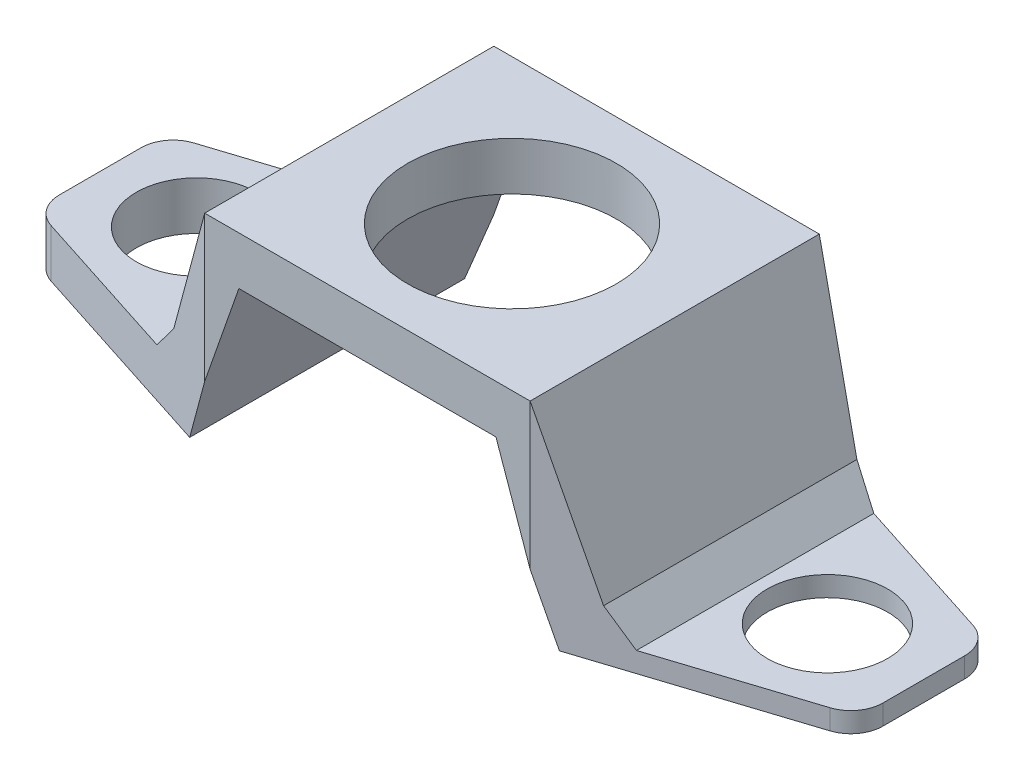
ISO-10303-21;
HEADER;
FILE_DESCRIPTION(('STEP AP214'),'2;1');
FILE_NAME('part.step','',(''),(''),'','','');
FILE_SCHEMA(('AUTOMOTIVE_DESIGN { 1 0 10303 214 1 1 1 1 }'));
ENDSEC;
DATA;
#1=APPLICATION_CONTEXT('core data for automotive mechanical design processes');
#2=APPLICATION_PROTOCOL_DEFINITION('international standard','automotive_design',2000,#1);
#3=PRODUCT_CONTEXT('',#1,'mechanical');
#4=PRODUCT('Part','Part','',(#3));
#5=PRODUCT_RELATED_PRODUCT_CATEGORY('part','',(#4));
#6=PRODUCT_DEFINITION_FORMATION('','',#4);
#7=PRODUCT_DEFINITION_CONTEXT('part definition',#1,'design');
#8=PRODUCT_DEFINITION('design','',#6,#7);
#9=PRODUCT_DEFINITION_SHAPE('','',#8);
#10=(LENGTH_UNIT() NAMED_UNIT(*) SI_UNIT(.MILLI.,.METRE.));
#11=(NAMED_UNIT(*) PLANE_ANGLE_UNIT() SI_UNIT($,.RADIAN.));
#12=(NAMED_UNIT(*) SI_UNIT($,.STERADIAN.) SOLID_ANGLE_UNIT());
#13=UNCERTAINTY_MEASURE_WITH_UNIT(LENGTH_MEASURE(1.E-05),#10,'distance_accuracy_value','');
#14=(GEOMETRIC_REPRESENTATION_CONTEXT(3) GLOBAL_UNCERTAINTY_ASSIGNED_CONTEXT((#13)) GLOBAL_UNIT_ASSIGNED_CONTEXT((#10,
#11,#12)) REPRESENTATION_CONTEXT('',''));
#15=CARTESIAN_POINT('',(0.,0.,0.));
#16=DIRECTION('',(0.,0.,1.));
#17=DIRECTION('',(1.,0.,0.));
#18=AXIS2_PLACEMENT_3D('',#15,#16,#17);
#19=CARTESIAN_POINT('',(-25.6335765484451,3.,9.));
#20=DIRECTION('',(1.,0.,0.));
#21=DIRECTION('',(0.,0.,-1.));
#22=AXIS2_PLACEMENT_3D('',#19,#20,#21);
#23=PLANE('',#22);
#24=DIRECTION('',(0.,0.,-1.));
#25=VECTOR('',#24,1.);
#26=CARTESIAN_POINT('',(-25.6335765484451,3.,9.));
#27=LINE('',#26,#25);
#28=CARTESIAN_POINT('',(-25.6335765484451,3.,2.54349252311762));
#29=VERTEX_POINT('',#28);
#30=CARTESIAN_POINT('',(-25.6335765484451,3.,-2.54349252311763));
#31=VERTEX_POINT('',#30);
#32=EDGE_CURVE('E199',#29,#31,#27,.T.);
#33=ORIENTED_EDGE('',*,*,#32,.T.);
#34=DIRECTION('',(0.,1.,0.));
#35=VECTOR('',#34,1.);
#36=CARTESIAN_POINT('',(-25.6335765484451,3.,-2.54349252311763));
#37=LINE('',#36,#35);
#38=CARTESIAN_POINT('',(-25.6335765484451,0.,-2.54349252311763));
#39=VERTEX_POINT('',#38);
#40=EDGE_CURVE('E280',#31,#39,#37,.F.);
#41=ORIENTED_EDGE('',*,*,#40,.T.);
#42=DIRECTION('',(0.,0.,-1.));
#43=VECTOR('',#42,1.);
#44=CARTESIAN_POINT('',(-25.6335765484451,0.,9.));
#45=LINE('',#44,#43);
#46=CARTESIAN_POINT('',(-25.6335765484451,0.,2.54349252311762));
#47=VERTEX_POINT('',#46);
#48=EDGE_CURVE('E236',#47,#39,#45,.T.);
#49=ORIENTED_EDGE('',*,*,#48,.F.);
#50=DIRECTION('',(0.,1.,0.));
#51=VECTOR('',#50,1.);
#52=CARTESIAN_POINT('',(-25.6335765484451,3.,2.54349252311762));
#53=LINE('',#52,#51);
#54=EDGE_CURVE('E277',#47,#29,#53,.T.);
#55=ORIENTED_EDGE('',*,*,#54,.T.);
#56=EDGE_LOOP('',(#33,#41,#49,#55));
#57=FACE_BOUND('',#56,.T.);
#58=ADVANCED_FACE('F33',(#57),#23,.F.);
#59=CARTESIAN_POINT('',(-25.6335765484451,0.,9.));
#60=DIRECTION('',(0.,1.,0.));
#61=DIRECTION('',(-1.,0.,0.));
#62=AXIS2_PLACEMENT_3D('',#59,#60,#61);
#63=PLANE('',#62);
#64=CARTESIAN_POINT('',(-19.6335765484451,0.,0.));
#65=DIRECTION('',(0.,1.,0.));
#66=DIRECTION('',(-1.,0.,0.));
#67=AXIS2_PLACEMENT_3D('',#64,#65,#66);
#68=CIRCLE('',#67,3.75);
#69=CARTESIAN_POINT('',(-19.6335765484451,0.,3.75));
#70=VERTEX_POINT('',#69);
#71=EDGE_CURVE('E322',#70,#70,#68,.F.);
#72=ORIENTED_EDGE('',*,*,#71,.F.);
#73=EDGE_LOOP('',(#72));
#74=FACE_BOUND('',#73,.T.);
#75=ORIENTED_EDGE('',*,*,#48,.T.);
#76=CARTESIAN_POINT('',(-23.6335765484451,0.,-2.54349252311763));
#77=DIRECTION('',(0.,1.,0.));
#78=DIRECTION('',(-1.,0.,0.));
#79=AXIS2_PLACEMENT_3D('',#76,#77,#78);
#80=CIRCLE('',#79,2.);
#81=CARTESIAN_POINT('',(-24.2473517188595,0.,-4.44698406241662));
#82=VERTEX_POINT('',#81);
#83=EDGE_CURVE('E284',#39,#82,#80,.F.);
#84=ORIENTED_EDGE('',*,*,#83,.T.);
#85=DIRECTION('',(0.951745769649497,0.,-0.306887585207168));
#86=VECTOR('',#85,1.);
#87=CARTESIAN_POINT('',(-29.4306030411705,0.,-2.77566013059427));
#88=LINE('',#87,#86);
#89=CARTESIAN_POINT('',(-11.5064234515549,0.,-8.55525838728262));
#90=VERTEX_POINT('',#89);
#91=EDGE_CURVE('E354',#82,#90,#88,.T.);
#92=ORIENTED_EDGE('',*,*,#91,.T.);
#93=DIRECTION('',(0.,0.,-1.));
#94=VECTOR('',#93,1.);
#95=CARTESIAN_POINT('',(-11.5064234515549,0.,9.));
#96=LINE('',#95,#94);
#97=CARTESIAN_POINT('',(-11.5064234515549,0.,8.55525838728262));
#98=VERTEX_POINT('',#97);
#99=EDGE_CURVE('E233',#98,#90,#96,.T.);
#100=ORIENTED_EDGE('',*,*,#99,.F.);
#101=DIRECTION('',(-0.951745769649497,0.,-0.306887585207168));
#102=VECTOR('',#101,1.);
#103=CARTESIAN_POINT('',(-24.1731817435508,0.,4.47089994977144));
#104=LINE('',#103,#102);
#105=CARTESIAN_POINT('',(-24.2473517188595,0.,4.44698406241662));
#106=VERTEX_POINT('',#105);
#107=EDGE_CURVE('E344',#98,#106,#104,.T.);
#108=ORIENTED_EDGE('',*,*,#107,.T.);
#109=CARTESIAN_POINT('',(-23.6335765484451,0.,2.54349252311762));
#110=DIRECTION('',(0.,1.,0.));
#111=DIRECTION('',(-1.,0.,0.));
#112=AXIS2_PLACEMENT_3D('',#109,#110,#111);
#113=CIRCLE('',#112,2.);
#114=EDGE_CURVE('E282',#106,#47,#113,.F.);
#115=ORIENTED_EDGE('',*,*,#114,.T.);
#116=EDGE_LOOP('',(#75,#84,#92,#100,#108,#115));
#117=FACE_BOUND('',#116,.T.);
#118=ADVANCED_FACE('F422',(#74,#117),#63,.F.);
#119=CARTESIAN_POINT('',(-11.5064234515549,0.,9.));
#120=DIRECTION('',(-0.943669198352679,0.330890380761382,0.));
#121=DIRECTION('',(-0.330890380761382,-0.943669198352679,0.));
#122=AXIS2_PLACEMENT_3D('',#119,#120,#121);
#123=PLANE('',#122);
#124=DIRECTION('',(0.330890380761382,0.943669198352679,0.));
#125=VECTOR('',#124,1.);
#126=CARTESIAN_POINT('',(-11.5064234515549,0.,9.));
#127=LINE('',#126,#125);
#128=CARTESIAN_POINT('',(-10.1271530968902,3.93355330216324,9.));
#129=VERTEX_POINT('',#128);
#130=CARTESIAN_POINT('',(-8.,10.,9.));
#131=VERTEX_POINT('',#130);
#132=EDGE_CURVE('E201',#129,#131,#127,.T.);
#133=ORIENTED_EDGE('',*,*,#132,.F.);
#134=DIRECTION('',(-0.329022924471758,-0.93834338327237,-0.106092460811382));
#135=VECTOR('',#134,1.);
#136=CARTESIAN_POINT('',(-11.4908989220258,0.0442745428314058,8.56026422553333));
#137=LINE('',#136,#135);
#138=EDGE_CURVE('E341',#129,#98,#137,.T.);
#139=ORIENTED_EDGE('',*,*,#138,.T.);
#140=ORIENTED_EDGE('',*,*,#99,.T.);
#141=DIRECTION('',(0.329022924471758,0.93834338327237,-0.106092460811382));
#142=VECTOR('',#141,1.);
#143=CARTESIAN_POINT('',(-12.119222252996,-1.74764631228258,-8.35766324119506));
#144=LINE('',#143,#142);
#145=CARTESIAN_POINT('',(-10.1271530968903,3.93355330216319,-9.));
#146=VERTEX_POINT('',#145);
#147=EDGE_CURVE('E351',#90,#146,#144,.T.);
#148=ORIENTED_EDGE('',*,*,#147,.T.);
#149=DIRECTION('',(0.330890380761382,0.943669198352679,0.));
#150=VECTOR('',#149,1.);
#151=CARTESIAN_POINT('',(-11.5064234515549,0.,-9.));
#152=LINE('',#151,#150);
#153=CARTESIAN_POINT('',(-8.,10.,-9.));
#154=VERTEX_POINT('',#153);
#155=EDGE_CURVE('E205',#146,#154,#152,.T.);
#156=ORIENTED_EDGE('',*,*,#155,.T.);
#157=DIRECTION('',(0.,0.,-1.));
#158=VECTOR('',#157,1.);
#159=CARTESIAN_POINT('',(-8.,10.,9.));
#160=LINE('',#159,#158);
#161=EDGE_CURVE('E230',#131,#154,#160,.T.);
#162=ORIENTED_EDGE('',*,*,#161,.F.);
#163=EDGE_LOOP('',(#133,#139,#140,#148,#156,#162));
#164=FACE_BOUND('',#163,.T.);
#165=ADVANCED_FACE('F364',(#164),#123,.F.);
#166=CARTESIAN_POINT('',(8.,9.99999999999999,9.));
#167=DIRECTION('',(0.,1.,0.));
#168=DIRECTION('',(0.,0.,1.));
#169=AXIS2_PLACEMENT_3D('',#166,#167,#168);
#170=PLANE('',#169);
#171=CARTESIAN_POINT('',(0.,9.99999999999999,0.));
#172=DIRECTION('',(0.,1.,0.));
#173=DIRECTION('',(0.,0.,1.));
#174=AXIS2_PLACEMENT_3D('',#171,#172,#173);
#175=CIRCLE('',#174,6.5);
#176=CARTESIAN_POINT('',(0.,9.99999999999999,6.5));
#177=VERTEX_POINT('',#176);
#178=EDGE_CURVE('E208',#177,#177,#175,.F.);
#179=ORIENTED_EDGE('',*,*,#178,.F.);
#180=EDGE_LOOP('',(#179));
#181=FACE_BOUND('',#180,.T.);
#182=DIRECTION('',(1.,0.,0.));
#183=VECTOR('',#182,1.);
#184=CARTESIAN_POINT('',(8.,9.99999999999999,-9.));
#185=LINE('',#184,#183);
#186=CARTESIAN_POINT('',(8.,9.99999999999999,-9.));
#187=VERTEX_POINT('',#186);
#188=EDGE_CURVE('E207',#154,#187,#185,.T.);
#189=ORIENTED_EDGE('',*,*,#188,.T.);
#190=DIRECTION('',(0.,0.,-1.));
#191=VECTOR('',#190,1.);
#192=CARTESIAN_POINT('',(8.,9.99999999999999,9.));
#193=LINE('',#192,#191);
#194=CARTESIAN_POINT('',(8.,9.99999999999999,9.));
#195=VERTEX_POINT('',#194);
#196=EDGE_CURVE('E228',#195,#187,#193,.T.);
#197=ORIENTED_EDGE('',*,*,#196,.F.);
#198=DIRECTION('',(1.,0.,0.));
#199=VECTOR('',#198,1.);
#200=CARTESIAN_POINT('',(-8.,10.,9.));
#201=LINE('',#200,#199);
#202=EDGE_CURVE('E195',#131,#195,#201,.T.);
#203=ORIENTED_EDGE('',*,*,#202,.F.);
#204=ORIENTED_EDGE('',*,*,#161,.T.);
#205=EDGE_LOOP('',(#189,#197,#203,#204));
#206=FACE_BOUND('',#205,.T.);
#207=ADVANCED_FACE('F368',(#181,#206),#170,.F.);
#208=CARTESIAN_POINT('',(11.5064234515549,0.,9.));
#209=DIRECTION('',(0.943669198352679,0.330890380761383,0.));
#210=DIRECTION('',(-0.330890380761383,0.943669198352679,0.));
#211=AXIS2_PLACEMENT_3D('',#208,#209,#210);
#212=PLANE('',#211);
#213=DIRECTION('',(0.,0.,-1.));
#214=VECTOR('',#213,1.);
#215=CARTESIAN_POINT('',(11.5064234515549,0.,9.));
#216=LINE('',#215,#214);
#217=CARTESIAN_POINT('',(11.5064234515549,0.,8.55525838728262));
#218=VERTEX_POINT('',#217);
#219=CARTESIAN_POINT('',(11.5064234515549,0.,-8.55525838728262));
#220=VERTEX_POINT('',#219);
#221=EDGE_CURVE('E189',#218,#220,#216,.T.);
#222=ORIENTED_EDGE('',*,*,#221,.F.);
#223=DIRECTION('',(-0.329022924471759,0.938343383272369,0.106092460811383));
#224=VECTOR('',#223,1.);
#225=CARTESIAN_POINT('',(11.4908989220258,0.044274542831406,8.56026422553333));
#226=LINE('',#225,#224);
#227=CARTESIAN_POINT('',(10.1271530968903,3.93355330216322,9.));
#228=VERTEX_POINT('',#227);
#229=EDGE_CURVE('E172',#218,#228,#226,.T.);
#230=ORIENTED_EDGE('',*,*,#229,.T.);
#231=DIRECTION('',(0.330890380761383,-0.943669198352679,0.));
#232=VECTOR('',#231,1.);
#233=CARTESIAN_POINT('',(11.5064234515549,0.,9.));
#234=LINE('',#233,#232);
#235=EDGE_CURVE('E187',#195,#228,#234,.T.);
#236=ORIENTED_EDGE('',*,*,#235,.F.);
#237=ORIENTED_EDGE('',*,*,#196,.T.);
#238=DIRECTION('',(0.330890380761383,-0.943669198352679,0.));
#239=VECTOR('',#238,1.);
#240=CARTESIAN_POINT('',(11.5064234515549,0.,-9.));
#241=LINE('',#240,#239);
#242=CARTESIAN_POINT('',(10.1271530968903,3.93355330216322,-9.));
#243=VERTEX_POINT('',#242);
#244=EDGE_CURVE('E210',#187,#243,#241,.T.);
#245=ORIENTED_EDGE('',*,*,#244,.T.);
#246=DIRECTION('',(0.329022924471759,-0.938343383272369,0.106092460811383));
#247=VECTOR('',#246,1.);
#248=CARTESIAN_POINT('',(12.119222252996,-1.74764631228259,-8.35766324119506));
#249=LINE('',#248,#247);
#250=EDGE_CURVE('E334',#243,#220,#249,.T.);
#251=ORIENTED_EDGE('',*,*,#250,.T.);
#252=EDGE_LOOP('',(#222,#230,#236,#237,#245,#251));
#253=FACE_BOUND('',#252,.T.);
#254=ADVANCED_FACE('F185',(#253),#212,.F.);
#255=CARTESIAN_POINT('',(25.6335765484451,0.,9.));
#256=DIRECTION('',(0.,1.,0.));
#257=DIRECTION('',(0.,0.,1.));
#258=AXIS2_PLACEMENT_3D('',#255,#256,#257);
#259=PLANE('',#258);
#260=CARTESIAN_POINT('',(19.6335765484451,0.,0.));
#261=DIRECTION('',(0.,1.,0.));
#262=DIRECTION('',(0.,0.,1.));
#263=AXIS2_PLACEMENT_3D('',#260,#261,#262);
#264=CIRCLE('',#263,3.75);
#265=CARTESIAN_POINT('',(19.6335765484451,0.,3.75));
#266=VERTEX_POINT('',#265);
#267=EDGE_CURVE('E316',#266,#266,#264,.F.);
#268=ORIENTED_EDGE('',*,*,#267,.F.);
#269=EDGE_LOOP('',(#268));
#270=FACE_BOUND('',#269,.T.);
#271=DIRECTION('',(0.951745769649497,0.,0.306887585207168));
#272=VECTOR('',#271,1.);
#273=CARTESIAN_POINT('',(29.4306030411705,0.,-2.77566013059427));
#274=LINE('',#273,#272);
#275=CARTESIAN_POINT('',(24.2473517188595,0.,-4.44698406241662));
#276=VERTEX_POINT('',#275);
#277=EDGE_CURVE('E331',#220,#276,#274,.T.);
#278=ORIENTED_EDGE('',*,*,#277,.T.);
#279=CARTESIAN_POINT('',(23.6335765484451,0.,-2.54349252311763));
#280=DIRECTION('',(0.,1.,0.));
#281=DIRECTION('',(0.,0.,1.));
#282=AXIS2_PLACEMENT_3D('',#279,#280,#281);
#283=CIRCLE('',#282,2.);
#284=CARTESIAN_POINT('',(25.6335765484451,0.,-2.54349252311763));
#285=VERTEX_POINT('',#284);
#286=EDGE_CURVE('E265',#276,#285,#283,.F.);
#287=ORIENTED_EDGE('',*,*,#286,.T.);
#288=DIRECTION('',(0.,0.,-1.));
#289=VECTOR('',#288,1.);
#290=CARTESIAN_POINT('',(25.6335765484451,0.,9.));
#291=LINE('',#290,#289);
#292=CARTESIAN_POINT('',(25.6335765484451,0.,2.54349252311763));
#293=VERTEX_POINT('',#292);
#294=EDGE_CURVE('E224',#293,#285,#291,.T.);
#295=ORIENTED_EDGE('',*,*,#294,.F.);
#296=CARTESIAN_POINT('',(23.6335765484451,0.,2.54349252311763));
#297=DIRECTION('',(0.,1.,0.));
#298=DIRECTION('',(0.,0.,1.));
#299=AXIS2_PLACEMENT_3D('',#296,#297,#298);
#300=CIRCLE('',#299,2.);
#301=CARTESIAN_POINT('',(24.2473517188595,0.,4.44698406241662));
#302=VERTEX_POINT('',#301);
#303=EDGE_CURVE('E263',#293,#302,#300,.F.);
#304=ORIENTED_EDGE('',*,*,#303,.T.);
#305=DIRECTION('',(-0.951745769649497,0.,0.306887585207168));
#306=VECTOR('',#305,1.);
#307=CARTESIAN_POINT('',(24.1731817435508,0.,4.47089994977144));
#308=LINE('',#307,#306);
#309=EDGE_CURVE('E191',#302,#218,#308,.T.);
#310=ORIENTED_EDGE('',*,*,#309,.T.);
#311=ORIENTED_EDGE('',*,*,#221,.T.);
#312=EDGE_LOOP('',(#278,#287,#295,#304,#310,#311));
#313=FACE_BOUND('',#312,.T.);
#314=ADVANCED_FACE('F376',(#270,#313),#259,.F.);
#315=CARTESIAN_POINT('',(25.6335765484451,3.,9.));
#316=DIRECTION('',(-1.,0.,0.));
#317=DIRECTION('',(0.,-1.,0.));
#318=AXIS2_PLACEMENT_3D('',#315,#316,#317);
#319=PLANE('',#318);
#320=ORIENTED_EDGE('',*,*,#294,.T.);
#321=DIRECTION('',(0.,1.,0.));
#322=VECTOR('',#321,1.);
#323=CARTESIAN_POINT('',(25.6335765484451,2.99999999999999,-2.54349252311763));
#324=LINE('',#323,#322);
#325=CARTESIAN_POINT('',(25.6335765484451,1.25,-2.54349252311763));
#326=VERTEX_POINT('',#325);
#327=EDGE_CURVE('E253',#285,#326,#324,.T.);
#328=ORIENTED_EDGE('',*,*,#327,.T.);
#329=DIRECTION('',(0.,0.,1.));
#330=VECTOR('',#329,1.);
#331=CARTESIAN_POINT('',(25.6335765484451,1.25,-10.));
#332=LINE('',#331,#330);
#333=CARTESIAN_POINT('',(25.6335765484451,1.25,2.54349252311763));
#334=VERTEX_POINT('',#333);
#335=EDGE_CURVE('E251',#326,#334,#332,.T.);
#336=ORIENTED_EDGE('',*,*,#335,.T.);
#337=DIRECTION('',(0.,1.,0.));
#338=VECTOR('',#337,1.);
#339=CARTESIAN_POINT('',(25.6335765484451,3.,2.54349252311763));
#340=LINE('',#339,#338);
#341=EDGE_CURVE('E180',#334,#293,#340,.F.);
#342=ORIENTED_EDGE('',*,*,#341,.T.);
#343=EDGE_LOOP('',(#320,#328,#336,#342));
#344=FACE_BOUND('',#343,.T.);
#345=ADVANCED_FACE('F383',(#344),#319,.F.);
#346=CARTESIAN_POINT('',(13.6335765484451,3.,9.));
#347=DIRECTION('',(-0.943669198352679,-0.330890380761383,0.));
#348=DIRECTION('',(0.330890380761383,-0.943669198352679,0.));
#349=AXIS2_PLACEMENT_3D('',#346,#347,#348);
#350=PLANE('',#349);
#351=DIRECTION('',(0.329022924471759,-0.938343383272369,-0.106092460811383));
#352=VECTOR('',#351,1.);
#353=CARTESIAN_POINT('',(13.5941096127345,3.11255610241015,7.88209021033261));
#354=LINE('',#353,#352);
#355=CARTESIAN_POINT('',(10.1271530968903,13.,9.));
#356=VERTEX_POINT('',#355);
#357=CARTESIAN_POINT('',(13.5854198909445,3.13733839670535,7.88489218521004));
#358=VERTEX_POINT('',#357);
#359=EDGE_CURVE('E175',#356,#358,#354,.T.);
#360=ORIENTED_EDGE('',*,*,#359,.T.);
#361=DIRECTION('',(0.,0.,-1.));
#362=VECTOR('',#361,1.);
#363=CARTESIAN_POINT('',(13.5854198909445,3.13733839670535,-7.67150295216404));
#364=LINE('',#363,#362);
#365=CARTESIAN_POINT('',(13.5854198909445,3.13733839670535,-7.88489218521004));
#366=VERTEX_POINT('',#365);
#367=EDGE_CURVE('E291',#358,#366,#364,.T.);
#368=ORIENTED_EDGE('',*,*,#367,.T.);
#369=DIRECTION('',(-0.329022924471759,0.938343383272369,-0.106092460811383));
#370=VECTOR('',#369,1.);
#371=CARTESIAN_POINT('',(14.2224329437047,1.32063524729615,-7.67948922599434));
#372=LINE('',#371,#370);
#373=CARTESIAN_POINT('',(10.1271530968903,13.,-9.));
#374=VERTEX_POINT('',#373);
#375=EDGE_CURVE('E190',#366,#374,#372,.T.);
#376=ORIENTED_EDGE('',*,*,#375,.T.);
#377=DIRECTION('',(0.,0.,-1.));
#378=VECTOR('',#377,1.);
#379=CARTESIAN_POINT('',(10.1271530968903,13.,9.));
#380=LINE('',#379,#378);
#381=EDGE_CURVE('E221',#356,#374,#380,.T.);
#382=ORIENTED_EDGE('',*,*,#381,.F.);
#383=EDGE_LOOP('',(#360,#368,#376,#382));
#384=FACE_BOUND('',#383,.T.);
#385=ADVANCED_FACE('F320',(#384),#350,.F.);
#386=CARTESIAN_POINT('',(-10.1271530968903,13.,9.));
#387=DIRECTION('',(0.,-1.,0.));
#388=DIRECTION('',(1.,0.,0.));
#389=AXIS2_PLACEMENT_3D('',#386,#387,#388);
#390=PLANE('',#389);
#391=CARTESIAN_POINT('',(0.,13.,0.));
#392=DIRECTION('',(0.,1.,0.));
#393=DIRECTION('',(-1.,0.,0.));
#394=AXIS2_PLACEMENT_3D('',#391,#392,#393);
#395=CIRCLE('',#394,6.5);
#396=CARTESIAN_POINT('',(-6.49999999999999,13.,0.));
#397=VERTEX_POINT('',#396);
#398=EDGE_CURVE('E356',#397,#397,#395,.T.);
#399=ORIENTED_EDGE('',*,*,#398,.F.);
#400=EDGE_LOOP('',(#399));
#401=FACE_BOUND('',#400,.T.);
#402=DIRECTION('',(-1.,0.,0.));
#403=VECTOR('',#402,1.);
#404=CARTESIAN_POINT('',(-10.1271530968903,13.,-9.));
#405=LINE('',#404,#403);
#406=CARTESIAN_POINT('',(-10.1271530968903,13.,-9.));
#407=VERTEX_POINT('',#406);
#408=EDGE_CURVE('E213',#374,#407,#405,.T.);
#409=ORIENTED_EDGE('',*,*,#408,.T.);
#410=DIRECTION('',(0.,0.,-1.));
#411=VECTOR('',#410,1.);
#412=CARTESIAN_POINT('',(-10.1271530968903,13.,9.));
#413=LINE('',#412,#411);
#414=CARTESIAN_POINT('',(-10.1271530968902,13.,9.));
#415=VERTEX_POINT('',#414);
#416=EDGE_CURVE('E218',#415,#407,#413,.T.);
#417=ORIENTED_EDGE('',*,*,#416,.F.);
#418=DIRECTION('',(-1.,0.,0.));
#419=VECTOR('',#418,1.);
#420=CARTESIAN_POINT('',(10.1271530968903,13.,9.));
#421=LINE('',#420,#419);
#422=EDGE_CURVE('E197',#356,#415,#421,.T.);
#423=ORIENTED_EDGE('',*,*,#422,.F.);
#424=ORIENTED_EDGE('',*,*,#381,.T.);
#425=EDGE_LOOP('',(#409,#417,#423,#424));
#426=FACE_BOUND('',#425,.T.);
#427=ADVANCED_FACE('F410',(#401,#426),#390,.F.);
#428=CARTESIAN_POINT('',(-13.6335765484451,3.,9.));
#429=DIRECTION('',(0.943669198352679,-0.330890380761382,0.));
#430=DIRECTION('',(0.330890380761383,0.943669198352679,0.));
#431=AXIS2_PLACEMENT_3D('',#428,#429,#430);
#432=PLANE('',#431);
#433=DIRECTION('',(-0.329022924471758,-0.93834338327237,0.106092460811382));
#434=VECTOR('',#433,1.);
#435=CARTESIAN_POINT('',(-14.2224329437047,1.32063524729616,-7.67948922599435));
#436=LINE('',#435,#434);
#437=CARTESIAN_POINT('',(-12.9717957869224,4.88733839670532,-8.08275344765369));
#438=VERTEX_POINT('',#437);
#439=EDGE_CURVE('E349',#407,#438,#436,.T.);
#440=ORIENTED_EDGE('',*,*,#439,.T.);
#441=DIRECTION('',(0.,0.,1.));
#442=VECTOR('',#441,1.);
#443=CARTESIAN_POINT('',(-12.9717957869224,4.88733839670532,7.86936421460769));
#444=LINE('',#443,#442);
#445=CARTESIAN_POINT('',(-12.9717957869224,4.88733839670532,8.08275344765369));
#446=VERTEX_POINT('',#445);
#447=EDGE_CURVE('E54',#438,#446,#444,.T.);
#448=ORIENTED_EDGE('',*,*,#447,.T.);
#449=DIRECTION('',(0.329022924471758,0.938343383272369,0.106092460811382));
#450=VECTOR('',#449,1.);
#451=CARTESIAN_POINT('',(-13.5941096127345,3.11255610241015,7.88209021033261));
#452=LINE('',#451,#450);
#453=EDGE_CURVE('E339',#446,#415,#452,.T.);
#454=ORIENTED_EDGE('',*,*,#453,.T.);
#455=ORIENTED_EDGE('',*,*,#416,.T.);
#456=EDGE_LOOP('',(#440,#448,#454,#455));
#457=FACE_BOUND('',#456,.T.);
#458=ADVANCED_FACE('F398',(#457),#432,.F.);
#459=CARTESIAN_POINT('',(-25.6335765484451,3.,9.));
#460=DIRECTION('',(0.,-1.,0.));
#461=DIRECTION('',(0.,0.,-1.));
#462=AXIS2_PLACEMENT_3D('',#459,#460,#461);
#463=PLANE('',#462);
#464=CARTESIAN_POINT('',(-19.6335765484451,3.,0.));
#465=DIRECTION('',(0.,1.,0.));
#466=DIRECTION('',(0.,0.,1.));
#467=AXIS2_PLACEMENT_3D('',#464,#465,#466);
#468=CIRCLE('',#467,3.75);
#469=CARTESIAN_POINT('',(-19.6335765484451,3.,3.75));
#470=VERTEX_POINT('',#469);
#471=EDGE_CURVE('E326',#470,#470,#468,.T.);
#472=ORIENTED_EDGE('',*,*,#471,.F.);
#473=EDGE_LOOP('',(#472));
#474=FACE_BOUND('',#473,.T.);
#475=DIRECTION('',(0.951745769649497,0.,0.306887585207168));
#476=VECTOR('',#475,1.);
#477=CARTESIAN_POINT('',(-24.1731817435508,3.,4.47089994977143));
#478=LINE('',#477,#476);
#479=CARTESIAN_POINT('',(-24.2473517188595,3.,4.44698406241662));
#480=VERTEX_POINT('',#479);
#481=CARTESIAN_POINT('',(-14.517820432236,3.,7.58424241119718));
#482=VERTEX_POINT('',#481);
#483=EDGE_CURVE('E336',#480,#482,#478,.T.);
#484=ORIENTED_EDGE('',*,*,#483,.T.);
#485=DIRECTION('',(0.,0.,-1.));
#486=VECTOR('',#485,1.);
#487=CARTESIAN_POINT('',(-14.517820432236,3.,-7.8693642146077));
#488=LINE('',#487,#486);
#489=CARTESIAN_POINT('',(-14.517820432236,3.,-7.58424241119718));
#490=VERTEX_POINT('',#489);
#491=EDGE_CURVE('E293',#482,#490,#488,.T.);
#492=ORIENTED_EDGE('',*,*,#491,.T.);
#493=DIRECTION('',(-0.951745769649497,0.,0.306887585207168));
#494=VECTOR('',#493,1.);
#495=CARTESIAN_POINT('',(-29.4306030411705,3.,-2.77566013059427));
#496=LINE('',#495,#494);
#497=CARTESIAN_POINT('',(-24.2473517188595,3.,-4.44698406241662));
#498=VERTEX_POINT('',#497);
#499=EDGE_CURVE('E347',#490,#498,#496,.T.);
#500=ORIENTED_EDGE('',*,*,#499,.T.);
#501=CARTESIAN_POINT('',(-23.6335765484451,3.,-2.54349252311763));
#502=DIRECTION('',(0.,-1.,0.));
#503=DIRECTION('',(0.,0.,-1.));
#504=AXIS2_PLACEMENT_3D('',#501,#502,#503);
#505=CIRCLE('',#504,2.);
#506=EDGE_CURVE('E275',#498,#31,#505,.F.);
#507=ORIENTED_EDGE('',*,*,#506,.T.);
#508=ORIENTED_EDGE('',*,*,#32,.F.);
#509=CARTESIAN_POINT('',(-23.6335765484451,3.,2.54349252311762));
#510=DIRECTION('',(0.,-1.,0.));
#511=DIRECTION('',(0.,0.,-1.));
#512=AXIS2_PLACEMENT_3D('',#509,#510,#511);
#513=CIRCLE('',#512,2.);
#514=EDGE_CURVE('E273',#29,#480,#513,.F.);
#515=ORIENTED_EDGE('',*,*,#514,.T.);
#516=EDGE_LOOP('',(#484,#492,#500,#507,#508,#515));
#517=FACE_BOUND('',#516,.T.);
#518=ADVANCED_FACE('F395',(#474,#517),#463,.F.);
#519=CARTESIAN_POINT('',(0.,0.,9.));
#520=DIRECTION('',(0.,0.,1.));
#521=DIRECTION('',(1.,0.,0.));
#522=AXIS2_PLACEMENT_3D('',#519,#520,#521);
#523=PLANE('',#522);
#524=DIRECTION('',(0.,-1.,0.));
#525=VECTOR('',#524,1.);
#526=CARTESIAN_POINT('',(10.1271530968903,0.,9.));
#527=LINE('',#526,#525);
#528=EDGE_CURVE('E168',#356,#228,#527,.T.);
#529=ORIENTED_EDGE('',*,*,#528,.F.);
#530=ORIENTED_EDGE('',*,*,#422,.T.);
#531=DIRECTION('',(0.,1.,0.));
#532=VECTOR('',#531,1.);
#533=CARTESIAN_POINT('',(-10.1271530968902,0.,9.));
#534=LINE('',#533,#532);
#535=EDGE_CURVE('E242',#129,#415,#534,.T.);
#536=ORIENTED_EDGE('',*,*,#535,.F.);
#537=ORIENTED_EDGE('',*,*,#132,.T.);
#538=ORIENTED_EDGE('',*,*,#202,.T.);
#539=ORIENTED_EDGE('',*,*,#235,.T.);
#540=EDGE_LOOP('',(#529,#530,#536,#537,#538,#539));
#541=FACE_BOUND('',#540,.T.);
#542=ADVANCED_FACE('F193',(#541),#523,.T.);
#543=CARTESIAN_POINT('',(0.,0.,-9.));
#544=DIRECTION('',(0.,0.,1.));
#545=DIRECTION('',(1.,0.,0.));
#546=AXIS2_PLACEMENT_3D('',#543,#544,#545);
#547=PLANE('',#546);
#548=ORIENTED_EDGE('',*,*,#408,.F.);
#549=DIRECTION('',(0.,-1.,0.));
#550=VECTOR('',#549,1.);
#551=CARTESIAN_POINT('',(10.1271530968903,0.,-9.));
#552=LINE('',#551,#550);
#553=EDGE_CURVE('E181',#374,#243,#552,.T.);
#554=ORIENTED_EDGE('',*,*,#553,.T.);
#555=ORIENTED_EDGE('',*,*,#244,.F.);
#556=ORIENTED_EDGE('',*,*,#188,.F.);
#557=ORIENTED_EDGE('',*,*,#155,.F.);
#558=DIRECTION('',(0.,1.,0.));
#559=VECTOR('',#558,1.);
#560=CARTESIAN_POINT('',(-10.1271530968903,0.,-9.));
#561=LINE('',#560,#559);
#562=EDGE_CURVE('E239',#146,#407,#561,.T.);
#563=ORIENTED_EDGE('',*,*,#562,.T.);
#564=EDGE_LOOP('',(#548,#554,#555,#556,#557,#563));
#565=FACE_BOUND('',#564,.T.);
#566=ADVANCED_FACE('F372',(#565),#547,.F.);
#567=CARTESIAN_POINT('',(0.,-0.00100000000001835,0.));
#568=DIRECTION('',(0.,1.,0.));
#569=DIRECTION('',(-1.,0.,0.));
#570=AXIS2_PLACEMENT_3D('',#567,#568,#569);
#571=CYLINDRICAL_SURFACE('',#570,6.5);
#572=ORIENTED_EDGE('',*,*,#398,.T.);
#573=EDGE_LOOP('',(#572));
#574=FACE_BOUND('',#573,.T.);
#575=ORIENTED_EDGE('',*,*,#178,.T.);
#576=EDGE_LOOP('',(#575));
#577=FACE_BOUND('',#576,.T.);
#578=ADVANCED_FACE('F505',(#574,#577),#571,.F.);
#579=CARTESIAN_POINT('',(-10.1271530968903,-5.,-9.));
#580=DIRECTION('',(0.306887585207168,0.,0.951745769649497));
#581=DIRECTION('',(0.951745769649497,0.,-0.306887585207168));
#582=AXIS2_PLACEMENT_3D('',#579,#580,#581);
#583=PLANE('',#582);
#584=ORIENTED_EDGE('',*,*,#91,.F.);
#585=DIRECTION('',(0.,1.,0.));
#586=VECTOR('',#585,1.);
#587=CARTESIAN_POINT('',(-24.2473517188595,-5.,-4.44698406241662));
#588=LINE('',#587,#586);
#589=EDGE_CURVE('E270',#82,#498,#588,.T.);
#590=ORIENTED_EDGE('',*,*,#589,.T.);
#591=ORIENTED_EDGE('',*,*,#499,.F.);
#592=DIRECTION('',(-0.620860803943776,-0.757927396464441,0.200194714752717));
#593=VECTOR('',#592,1.);
#594=CARTESIAN_POINT('',(-16.4139285410941,0.685290691193199,-6.97284800591027));
#595=LINE('',#594,#593);
#596=EDGE_CURVE('E41',#490,#438,#595,.F.);
#597=ORIENTED_EDGE('',*,*,#596,.T.);
#598=ORIENTED_EDGE('',*,*,#439,.F.);
#599=ORIENTED_EDGE('',*,*,#562,.F.);
#600=ORIENTED_EDGE('',*,*,#147,.F.);
#601=EDGE_LOOP('',(#584,#590,#591,#597,#598,#599,#600));
#602=FACE_BOUND('',#601,.T.);
#603=ADVANCED_FACE('F496',(#602),#583,.F.);
#604=CARTESIAN_POINT('',(-10.1271530968903,-5.,9.));
#605=DIRECTION('',(0.306887585207168,0.,-0.951745769649497));
#606=DIRECTION('',(-0.951745769649497,0.,-0.306887585207168));
#607=AXIS2_PLACEMENT_3D('',#604,#605,#606);
#608=PLANE('',#607);
#609=ORIENTED_EDGE('',*,*,#483,.F.);
#610=DIRECTION('',(0.,1.,0.));
#611=VECTOR('',#610,1.);
#612=CARTESIAN_POINT('',(-24.2473517188595,-5.,4.44698406241662));
#613=LINE('',#612,#611);
#614=EDGE_CURVE('E286',#480,#106,#613,.F.);
#615=ORIENTED_EDGE('',*,*,#614,.T.);
#616=ORIENTED_EDGE('',*,*,#107,.F.);
#617=ORIENTED_EDGE('',*,*,#138,.F.);
#618=ORIENTED_EDGE('',*,*,#535,.T.);
#619=ORIENTED_EDGE('',*,*,#453,.F.);
#620=DIRECTION('',(0.620860803943776,0.757927396464441,0.200194714752717));
#621=VECTOR('',#620,1.);
#622=CARTESIAN_POINT('',(-16.4139285410941,0.685290691193207,6.97284800591027));
#623=LINE('',#622,#621);
#624=EDGE_CURVE('E11',#446,#482,#623,.F.);
#625=ORIENTED_EDGE('',*,*,#624,.T.);
#626=EDGE_LOOP('',(#609,#615,#616,#617,#618,#619,#625));
#627=FACE_BOUND('',#626,.T.);
#628=ADVANCED_FACE('F407',(#627),#608,.F.);
#629=CARTESIAN_POINT('',(10.1271530968902,-5.00000000000001,-9.));
#630=DIRECTION('',(-0.306887585207168,0.,0.951745769649497));
#631=DIRECTION('',(0.951745769649497,0.,0.306887585207168));
#632=AXIS2_PLACEMENT_3D('',#629,#630,#631);
#633=PLANE('',#632);
#634=ORIENTED_EDGE('',*,*,#375,.F.);
#635=DIRECTION('',(-0.620860803943777,0.75792739646444,-0.200194714752718));
#636=VECTOR('',#635,1.);
#637=CARTESIAN_POINT('',(15.9429343520675,0.25935868483411,-7.12471867760257));
#638=LINE('',#637,#636);
#639=CARTESIAN_POINT('',(15.1314445362581,1.25,-7.38638114875352));
#640=VERTEX_POINT('',#639);
#641=EDGE_CURVE('E299',#366,#640,#638,.F.);
#642=ORIENTED_EDGE('',*,*,#641,.T.);
#643=DIRECTION('',(0.951745769649497,0.,0.306887585207168));
#644=VECTOR('',#643,1.);
#645=CARTESIAN_POINT('',(10.1271530968902,1.25,-9.));
#646=LINE('',#645,#644);
#647=CARTESIAN_POINT('',(24.2473517188595,1.25,-4.44698406241662));
#648=VERTEX_POINT('',#647);
#649=EDGE_CURVE('E305',#640,#648,#646,.T.);
#650=ORIENTED_EDGE('',*,*,#649,.T.);
#651=DIRECTION('',(0.,1.,0.));
#652=VECTOR('',#651,1.);
#653=CARTESIAN_POINT('',(24.2473517188595,-4.99999999999999,-4.44698406241662));
#654=LINE('',#653,#652);
#655=EDGE_CURVE('E261',#648,#276,#654,.F.);
#656=ORIENTED_EDGE('',*,*,#655,.T.);
#657=ORIENTED_EDGE('',*,*,#277,.F.);
#658=ORIENTED_EDGE('',*,*,#250,.F.);
#659=ORIENTED_EDGE('',*,*,#553,.F.);
#660=EDGE_LOOP('',(#634,#642,#650,#656,#657,#658,#659));
#661=FACE_BOUND('',#660,.T.);
#662=ADVANCED_FACE('F304',(#661),#633,.F.);
#663=CARTESIAN_POINT('',(10.1271530968902,-5.00000000000001,9.));
#664=DIRECTION('',(-0.306887585207168,0.,-0.951745769649497));
#665=DIRECTION('',(-0.951745769649497,0.,0.306887585207168));
#666=AXIS2_PLACEMENT_3D('',#663,#664,#665);
#667=PLANE('',#666);
#668=ORIENTED_EDGE('',*,*,#309,.F.);
#669=DIRECTION('',(0.,1.,0.));
#670=VECTOR('',#669,1.);
#671=CARTESIAN_POINT('',(24.2473517188595,-4.99999999999999,4.44698406241662));
#672=LINE('',#671,#670);
#673=CARTESIAN_POINT('',(24.2473517188595,1.25,4.44698406241662));
#674=VERTEX_POINT('',#673);
#675=EDGE_CURVE('E267',#302,#674,#672,.T.);
#676=ORIENTED_EDGE('',*,*,#675,.T.);
#677=DIRECTION('',(-0.951745769649497,0.,0.306887585207168));
#678=VECTOR('',#677,1.);
#679=CARTESIAN_POINT('',(10.1271530968902,1.25,9.));
#680=LINE('',#679,#678);
#681=CARTESIAN_POINT('',(15.1314445362581,1.25,7.38638114875352));
#682=VERTEX_POINT('',#681);
#683=EDGE_CURVE('E250',#674,#682,#680,.T.);
#684=ORIENTED_EDGE('',*,*,#683,.T.);
#685=DIRECTION('',(0.620860803943777,-0.75792739646444,-0.200194714752718));
#686=VECTOR('',#685,1.);
#687=CARTESIAN_POINT('',(15.9429343520675,0.25935868483411,7.12471867760257));
#688=LINE('',#687,#686);
#689=EDGE_CURVE('E297',#682,#358,#688,.F.);
#690=ORIENTED_EDGE('',*,*,#689,.T.);
#691=ORIENTED_EDGE('',*,*,#359,.F.);
#692=ORIENTED_EDGE('',*,*,#528,.T.);
#693=ORIENTED_EDGE('',*,*,#229,.F.);
#694=EDGE_LOOP('',(#668,#676,#684,#690,#691,#692,#693));
#695=FACE_BOUND('',#694,.T.);
#696=ADVANCED_FACE('F171',(#695),#667,.F.);
#697=CARTESIAN_POINT('',(-19.6335765484451,-0.00100000000000013,0.));
#698=DIRECTION('',(0.,1.,0.));
#699=DIRECTION('',(0.,0.,1.));
#700=AXIS2_PLACEMENT_3D('',#697,#698,#699);
#701=CYLINDRICAL_SURFACE('',#700,3.75);
#702=CARTESIAN_POINT('',(-19.6335765484451,3.,3.75));
#703=CARTESIAN_POINT('',(-19.6335765484451,2.96875,3.75));
#704=CARTESIAN_POINT('',(-19.6335765484451,2.9375,3.75));
#705=CARTESIAN_POINT('',(-19.6335765484451,2.875,3.75));
#706=CARTESIAN_POINT('',(-19.6335765484451,2.84375,3.75));
#707=CARTESIAN_POINT('',(-19.6335765484451,2.78125,3.75));
#708=CARTESIAN_POINT('',(-19.6335765484451,2.75,3.75));
#709=CARTESIAN_POINT('',(-19.6335765484451,2.6875,3.75));
#710=CARTESIAN_POINT('',(-19.6335765484451,2.65625,3.75));
#711=CARTESIAN_POINT('',(-19.6335765484451,2.59375,3.75));
#712=CARTESIAN_POINT('',(-19.6335765484451,2.5625,3.75));
#713=CARTESIAN_POINT('',(-19.6335765484451,2.5,3.75));
#714=CARTESIAN_POINT('',(-19.6335765484451,2.46875,3.75));
#715=CARTESIAN_POINT('',(-19.6335765484451,2.40625,3.75));
#716=CARTESIAN_POINT('',(-19.6335765484451,2.375,3.75));
#717=CARTESIAN_POINT('',(-19.6335765484451,2.3125,3.75));
#718=CARTESIAN_POINT('',(-19.6335765484451,2.28125,3.75));
#719=CARTESIAN_POINT('',(-19.6335765484451,2.21875,3.75));
#720=CARTESIAN_POINT('',(-19.6335765484451,2.1875,3.75));
#721=CARTESIAN_POINT('',(-19.6335765484451,2.125,3.75));
#722=CARTESIAN_POINT('',(-19.6335765484451,2.09375,3.75));
#723=CARTESIAN_POINT('',(-19.6335765484451,2.03125,3.75));
#724=CARTESIAN_POINT('',(-19.6335765484451,2.,3.75));
#725=CARTESIAN_POINT('',(-19.6335765484451,1.9375,3.75));
#726=CARTESIAN_POINT('',(-19.6335765484451,1.90625,3.75));
#727=CARTESIAN_POINT('',(-19.6335765484451,1.84375,3.75));
#728=CARTESIAN_POINT('',(-19.6335765484451,1.8125,3.75));
#729=CARTESIAN_POINT('',(-19.6335765484451,1.75,3.75));
#730=CARTESIAN_POINT('',(-19.6335765484451,1.71875,3.75));
#731=CARTESIAN_POINT('',(-19.6335765484451,1.65625,3.75));
#732=CARTESIAN_POINT('',(-19.6335765484451,1.625,3.75));
#733=CARTESIAN_POINT('',(-19.6335765484451,1.5625,3.75));
#734=CARTESIAN_POINT('',(-19.6335765484451,1.53125,3.75));
#735=CARTESIAN_POINT('',(-19.6335765484451,1.46875,3.75));
#736=CARTESIAN_POINT('',(-19.6335765484451,1.4375,3.75));
#737=CARTESIAN_POINT('',(-19.6335765484451,1.375,3.75));
#738=CARTESIAN_POINT('',(-19.6335765484451,1.34375,3.75));
#739=CARTESIAN_POINT('',(-19.6335765484451,1.28125,3.75));
#740=CARTESIAN_POINT('',(-19.6335765484451,1.25,3.75));
#741=CARTESIAN_POINT('',(-19.6335765484451,1.1875,3.75));
#742=CARTESIAN_POINT('',(-19.6335765484451,1.15625,3.75));
#743=CARTESIAN_POINT('',(-19.6335765484451,1.09375,3.75));
#744=CARTESIAN_POINT('',(-19.6335765484451,1.0625,3.75));
#745=CARTESIAN_POINT('',(-19.6335765484451,1.,3.75));
#746=CARTESIAN_POINT('',(-19.6335765484451,0.96875,3.75));
#747=CARTESIAN_POINT('',(-19.6335765484451,0.90625,3.75));
#748=CARTESIAN_POINT('',(-19.6335765484451,0.875,3.75));
#749=CARTESIAN_POINT('',(-19.6335765484451,0.8125,3.75));
#750=CARTESIAN_POINT('',(-19.6335765484451,0.78125,3.75));
#751=CARTESIAN_POINT('',(-19.6335765484451,0.71875,3.75));
#752=CARTESIAN_POINT('',(-19.6335765484451,0.6875,3.75));
#753=CARTESIAN_POINT('',(-19.6335765484451,0.625,3.75));
#754=CARTESIAN_POINT('',(-19.6335765484451,0.59375,3.75));
#755=CARTESIAN_POINT('',(-19.6335765484451,0.53125,3.75));
#756=CARTESIAN_POINT('',(-19.6335765484451,0.5,3.75));
#757=CARTESIAN_POINT('',(-19.6335765484451,0.4375,3.75));
#758=CARTESIAN_POINT('',(-19.6335765484451,0.40625,3.75));
#759=CARTESIAN_POINT('',(-19.6335765484451,0.34375,3.75));
#760=CARTESIAN_POINT('',(-19.6335765484451,0.3125,3.75));
#761=CARTESIAN_POINT('',(-19.6335765484451,0.25,3.75));
#762=CARTESIAN_POINT('',(-19.6335765484451,0.21875,3.75));
#763=CARTESIAN_POINT('',(-19.6335765484451,0.15625,3.75));
#764=CARTESIAN_POINT('',(-19.6335765484451,0.125,3.75));
#765=CARTESIAN_POINT('',(-19.6335765484451,0.0625000000000001,3.75));
#766=CARTESIAN_POINT('',(-19.6335765484451,0.0312500000000001,3.75));
#767=CARTESIAN_POINT('',(-19.6335765484451,0.,3.75));
#768=B_SPLINE_CURVE_WITH_KNOTS('',3,(#702,#703,#704,#705,#706,#707,#708,#709,#710,#711,#712,
#713,#714,#715,#716,#717,#718,#719,#720,#721,#722,#723,#724,#725,#726,#727,#728,#729,#730,#731,
#732,#733,#734,#735,#736,#737,#738,#739,#740,#741,#742,#743,#744,#745,#746,#747,#748,#749,#750,
#751,#752,#753,#754,#755,#756,#757,#758,#759,#760,#761,#762,#763,#764,#765,#766,#767),
.UNSPECIFIED.,.F.,.F.,(4,2,2,2,2,2,2,2,2,2,2,2,2,2,2,2,2,2,2,2,2,2,2,2,2,2,2,2,2,2,2,2,4),(0.,
0.0937500000000001,0.1875,0.28125,0.375,0.46875,0.5625,0.65625,0.75,0.84375,0.9375,1.03125,
1.125,1.21875,1.3125,1.40625,1.5,1.59375,1.6875,1.78125,1.875,1.96875,2.0625,2.15625,2.25,
2.34375,2.4375,2.53125,2.625,2.71875,2.8125,2.90625,3.),.UNSPECIFIED.);
#769=EDGE_CURVE('BSEAM392',#470,#70,#768,.T.);
#770=ORIENTED_EDGE('',*,*,#471,.T.);
#771=ORIENTED_EDGE('',*,*,#71,.T.);
#772=ORIENTED_EDGE('',*,*,#769,.T.);
#773=ORIENTED_EDGE('',*,*,#769,.F.);
#774=EDGE_LOOP('',(#770,#772,#771,#773));
#775=FACE_BOUND('',#774,.T.);
#776=ADVANCED_FACE('F392',(#775),#701,.F.);
#777=CARTESIAN_POINT('',(19.6335765484451,-0.00100000000000013,0.));
#778=DIRECTION('',(0.,1.,0.));
#779=DIRECTION('',(0.,0.,1.));
#780=AXIS2_PLACEMENT_3D('',#777,#778,#779);
#781=CYLINDRICAL_SURFACE('',#780,3.75);
#782=CARTESIAN_POINT('',(19.6335765484451,1.25,0.));
#783=DIRECTION('',(0.,-1.,0.));
#784=DIRECTION('',(0.,0.,-1.));
#785=AXIS2_PLACEMENT_3D('',#782,#783,#784);
#786=CIRCLE('',#785,3.75);
#787=CARTESIAN_POINT('',(19.6335765484451,1.25,3.75));
#788=VERTEX_POINT('',#787);
#789=EDGE_CURVE('E247',#788,#788,#786,.F.);
#790=CARTESIAN_POINT('',(19.6335765484451,1.25,3.75));
#791=CARTESIAN_POINT('',(19.6335765484451,1.23697916666667,3.75));
#792=CARTESIAN_POINT('',(19.6335765484451,1.22395833333333,3.75));
#793=CARTESIAN_POINT('',(19.6335765484451,1.19791666666667,3.75));
#794=CARTESIAN_POINT('',(19.6335765484451,1.18489583333333,3.75));
#795=CARTESIAN_POINT('',(19.6335765484451,1.15885416666667,3.75));
#796=CARTESIAN_POINT('',(19.6335765484451,1.14583333333333,3.75));
#797=CARTESIAN_POINT('',(19.6335765484451,1.11979166666667,3.75));
#798=CARTESIAN_POINT('',(19.6335765484451,1.10677083333333,3.75));
#799=CARTESIAN_POINT('',(19.6335765484451,1.08072916666667,3.75));
#800=CARTESIAN_POINT('',(19.6335765484451,1.06770833333333,3.75));
#801=CARTESIAN_POINT('',(19.6335765484451,1.04166666666667,3.75));
#802=CARTESIAN_POINT('',(19.6335765484451,1.02864583333333,3.75));
#803=CARTESIAN_POINT('',(19.6335765484451,1.00260416666667,3.75));
#804=CARTESIAN_POINT('',(19.6335765484451,0.989583333333334,3.75));
#805=CARTESIAN_POINT('',(19.6335765484451,0.963541666666667,3.75));
#806=CARTESIAN_POINT('',(19.6335765484451,0.950520833333334,3.75));
#807=CARTESIAN_POINT('',(19.6335765484451,0.924479166666667,3.75));
#808=CARTESIAN_POINT('',(19.6335765484451,0.911458333333334,3.75));
#809=CARTESIAN_POINT('',(19.6335765484451,0.885416666666667,3.75));
#810=CARTESIAN_POINT('',(19.6335765484451,0.872395833333334,3.75));
#811=CARTESIAN_POINT('',(19.6335765484451,0.846354166666667,3.75));
#812=CARTESIAN_POINT('',(19.6335765484451,0.833333333333334,3.75));
#813=CARTESIAN_POINT('',(19.6335765484451,0.807291666666667,3.75));
#814=CARTESIAN_POINT('',(19.6335765484451,0.794270833333334,3.75));
#815=CARTESIAN_POINT('',(19.6335765484451,0.768229166666667,3.75));
#816=CARTESIAN_POINT('',(19.6335765484451,0.755208333333334,3.75));
#817=CARTESIAN_POINT('',(19.6335765484451,0.729166666666667,3.75));
#818=CARTESIAN_POINT('',(19.6335765484451,0.716145833333334,3.75));
#819=CARTESIAN_POINT('',(19.6335765484451,0.690104166666667,3.75));
#820=CARTESIAN_POINT('',(19.6335765484451,0.677083333333334,3.75));
#821=CARTESIAN_POINT('',(19.6335765484451,0.651041666666667,3.75));
#822=CARTESIAN_POINT('',(19.6335765484451,0.638020833333334,3.75));
#823=CARTESIAN_POINT('',(19.6335765484451,0.611979166666667,3.75));
#824=CARTESIAN_POINT('',(19.6335765484451,0.598958333333334,3.75));
#825=CARTESIAN_POINT('',(19.6335765484451,0.572916666666667,3.75));
#826=CARTESIAN_POINT('',(19.6335765484451,0.559895833333334,3.75));
#827=CARTESIAN_POINT('',(19.6335765484451,0.533854166666667,3.75));
#828=CARTESIAN_POINT('',(19.6335765484451,0.520833333333334,3.75));
#829=CARTESIAN_POINT('',(19.6335765484451,0.494791666666667,3.75));
#830=CARTESIAN_POINT('',(19.6335765484451,0.481770833333334,3.75));
#831=CARTESIAN_POINT('',(19.6335765484451,0.455729166666667,3.75));
#832=CARTESIAN_POINT('',(19.6335765484451,0.442708333333334,3.75));
#833=CARTESIAN_POINT('',(19.6335765484451,0.416666666666667,3.75));
#834=CARTESIAN_POINT('',(19.6335765484451,0.403645833333334,3.75));
#835=CARTESIAN_POINT('',(19.6335765484451,0.377604166666667,3.75));
#836=CARTESIAN_POINT('',(19.6335765484451,0.364583333333334,3.75));
#837=CARTESIAN_POINT('',(19.6335765484451,0.338541666666667,3.75));
#838=CARTESIAN_POINT('',(19.6335765484451,0.325520833333334,3.75));
#839=CARTESIAN_POINT('',(19.6335765484451,0.299479166666667,3.75));
#840=CARTESIAN_POINT('',(19.6335765484451,0.286458333333334,3.75));
#841=CARTESIAN_POINT('',(19.6335765484451,0.260416666666667,3.75));
#842=CARTESIAN_POINT('',(19.6335765484451,0.247395833333334,3.75));
#843=CARTESIAN_POINT('',(19.6335765484451,0.221354166666667,3.75));
#844=CARTESIAN_POINT('',(19.6335765484451,0.208333333333333,3.75));
#845=CARTESIAN_POINT('',(19.6335765484451,0.182291666666667,3.75));
#846=CARTESIAN_POINT('',(19.6335765484451,0.169270833333333,3.75));
#847=CARTESIAN_POINT('',(19.6335765484451,0.143229166666667,3.75));
#848=CARTESIAN_POINT('',(19.6335765484451,0.130208333333333,3.75));
#849=CARTESIAN_POINT('',(19.6335765484451,0.104166666666667,3.75));
#850=CARTESIAN_POINT('',(19.6335765484451,0.0911458333333334,3.75));
#851=CARTESIAN_POINT('',(19.6335765484451,0.0651041666666667,3.75));
#852=CARTESIAN_POINT('',(19.6335765484451,0.0520833333333334,3.75));
#853=CARTESIAN_POINT('',(19.6335765484451,0.0260416666666667,3.75));
#854=CARTESIAN_POINT('',(19.6335765484451,0.0130208333333334,3.75));
#855=CARTESIAN_POINT('',(19.6335765484451,0.,3.75));
#856=B_SPLINE_CURVE_WITH_KNOTS('',3,(#790,#791,#792,#793,#794,#795,#796,#797,#798,#799,#800,
#801,#802,#803,#804,#805,#806,#807,#808,#809,#810,#811,#812,#813,#814,#815,#816,#817,#818,#819,
#820,#821,#822,#823,#824,#825,#826,#827,#828,#829,#830,#831,#832,#833,#834,#835,#836,#837,#838,
#839,#840,#841,#842,#843,#844,#845,#846,#847,#848,#849,#850,#851,#852,#853,#854,#855),
.UNSPECIFIED.,.F.,.F.,(4,2,2,2,2,2,2,2,2,2,2,2,2,2,2,2,2,2,2,2,2,2,2,2,2,2,2,2,2,2,2,2,4),(0.,
0.0390625,0.0781250000000001,0.1171875,0.15625,0.1953125,0.234375,0.2734375,0.3125,0.3515625,
0.390625,0.4296875,0.46875,0.5078125,0.546875,0.5859375,0.625,0.6640625,0.703125000000001,
0.742187500000001,0.78125,0.820312500000001,0.859375000000001,0.898437500000001,
0.937500000000001,0.976562500000001,1.015625,1.0546875,1.09375,1.1328125,1.171875,1.2109375,
1.25),.UNSPECIFIED.);
#857=EDGE_CURVE('BSEAM465',#788,#266,#856,.T.);
#858=ORIENTED_EDGE('',*,*,#789,.T.);
#859=ORIENTED_EDGE('',*,*,#267,.T.);
#860=ORIENTED_EDGE('',*,*,#857,.T.);
#861=ORIENTED_EDGE('',*,*,#857,.F.);
#862=EDGE_LOOP('',(#858,#860,#859,#861));
#863=FACE_BOUND('',#862,.T.);
#864=ADVANCED_FACE('F465',(#863),#781,.F.);
#865=CARTESIAN_POINT('',(14.2472006524672,1.25,-10.));
#866=DIRECTION('',(0.,-1.,0.));
#867=DIRECTION('',(0.,0.,-1.));
#868=AXIS2_PLACEMENT_3D('',#865,#866,#867);
#869=PLANE('',#868);
#870=ORIENTED_EDGE('',*,*,#789,.F.);
#871=EDGE_LOOP('',(#870));
#872=FACE_BOUND('',#871,.T.);
#873=ORIENTED_EDGE('',*,*,#649,.F.);
#874=DIRECTION('',(0.,0.,1.));
#875=VECTOR('',#874,1.);
#876=CARTESIAN_POINT('',(15.1314445362581,1.25,7.67150295216404));
#877=LINE('',#876,#875);
#878=EDGE_CURVE('E288',#640,#682,#877,.T.);
#879=ORIENTED_EDGE('',*,*,#878,.T.);
#880=ORIENTED_EDGE('',*,*,#683,.F.);
#881=CARTESIAN_POINT('',(23.6335765484451,1.25,2.54349252311763));
#882=DIRECTION('',(0.,-1.,0.));
#883=DIRECTION('',(0.,0.,-1.));
#884=AXIS2_PLACEMENT_3D('',#881,#882,#883);
#885=CIRCLE('',#884,2.);
#886=EDGE_CURVE('E256',#674,#334,#885,.F.);
#887=ORIENTED_EDGE('',*,*,#886,.T.);
#888=ORIENTED_EDGE('',*,*,#335,.F.);
#889=CARTESIAN_POINT('',(23.6335765484451,1.25,-2.54349252311763));
#890=DIRECTION('',(0.,-1.,0.));
#891=DIRECTION('',(0.,0.,-1.));
#892=AXIS2_PLACEMENT_3D('',#889,#890,#891);
#893=CIRCLE('',#892,2.);
#894=EDGE_CURVE('E258',#326,#648,#893,.F.);
#895=ORIENTED_EDGE('',*,*,#894,.T.);
#896=EDGE_LOOP('',(#873,#879,#880,#887,#888,#895));
#897=FACE_BOUND('',#896,.T.);
#898=ADVANCED_FACE('F311',(#872,#897),#869,.F.);
#899=CARTESIAN_POINT('',(23.6335765484451,2.99999999999999,-2.54349252311763));
#900=DIRECTION('',(0.,1.,0.));
#901=DIRECTION('',(-1.,0.,0.));
#902=AXIS2_PLACEMENT_3D('',#899,#900,#901);
#903=CYLINDRICAL_SURFACE('',#902,2.);
#904=ORIENTED_EDGE('',*,*,#286,.F.);
#905=ORIENTED_EDGE('',*,*,#655,.F.);
#906=ORIENTED_EDGE('',*,*,#894,.F.);
#907=ORIENTED_EDGE('',*,*,#327,.F.);
#908=EDGE_LOOP('',(#904,#905,#906,#907));
#909=FACE_BOUND('',#908,.T.);
#910=ADVANCED_FACE('F380',(#909),#903,.T.);
#911=CARTESIAN_POINT('',(23.6335765484451,-4.99999999999999,2.54349252311762));
#912=DIRECTION('',(0.,1.,0.));
#913=DIRECTION('',(-1.,0.,0.));
#914=AXIS2_PLACEMENT_3D('',#911,#912,#913);
#915=CYLINDRICAL_SURFACE('',#914,2.);
#916=ORIENTED_EDGE('',*,*,#303,.F.);
#917=ORIENTED_EDGE('',*,*,#341,.F.);
#918=ORIENTED_EDGE('',*,*,#886,.F.);
#919=ORIENTED_EDGE('',*,*,#675,.F.);
#920=EDGE_LOOP('',(#916,#917,#918,#919));
#921=FACE_BOUND('',#920,.T.);
#922=ADVANCED_FACE('F434',(#921),#915,.T.);
#923=CARTESIAN_POINT('',(-23.6335765484451,-5.,-2.54349252311763));
#924=DIRECTION('',(0.,1.,0.));
#925=DIRECTION('',(0.,0.,1.));
#926=AXIS2_PLACEMENT_3D('',#923,#924,#925);
#927=CYLINDRICAL_SURFACE('',#926,2.);
#928=ORIENTED_EDGE('',*,*,#83,.F.);
#929=ORIENTED_EDGE('',*,*,#40,.F.);
#930=ORIENTED_EDGE('',*,*,#506,.F.);
#931=ORIENTED_EDGE('',*,*,#589,.F.);
#932=EDGE_LOOP('',(#928,#929,#930,#931));
#933=FACE_BOUND('',#932,.T.);
#934=ADVANCED_FACE('F437',(#933),#927,.T.);
#935=CARTESIAN_POINT('',(-23.6335765484451,3.,2.54349252311762));
#936=DIRECTION('',(0.,1.,0.));
#937=DIRECTION('',(0.,0.,1.));
#938=AXIS2_PLACEMENT_3D('',#935,#936,#937);
#939=CYLINDRICAL_SURFACE('',#938,2.);
#940=ORIENTED_EDGE('',*,*,#114,.F.);
#941=ORIENTED_EDGE('',*,*,#614,.F.);
#942=ORIENTED_EDGE('',*,*,#514,.F.);
#943=ORIENTED_EDGE('',*,*,#54,.F.);
#944=EDGE_LOOP('',(#940,#941,#942,#943));
#945=FACE_BOUND('',#944,.T.);
#946=ADVANCED_FACE('F441',(#945),#939,.T.);
#947=CARTESIAN_POINT('',(15.1314445362581,1.25,-10.));
#948=DIRECTION('',(0.77358780670187,0.633689123563117,0.));
#949=DIRECTION('',(0.,0.,-1.));
#950=AXIS2_PLACEMENT_3D('',#947,#948,#949);
#951=PLANE('',#950);
#952=ORIENTED_EDGE('',*,*,#641,.F.);
#953=ORIENTED_EDGE('',*,*,#367,.F.);
#954=ORIENTED_EDGE('',*,*,#689,.F.);
#955=ORIENTED_EDGE('',*,*,#878,.F.);
#956=EDGE_LOOP('',(#952,#953,#954,#955));
#957=FACE_BOUND('',#956,.T.);
#958=ADVANCED_FACE('F318',(#957),#951,.T.);
#959=CARTESIAN_POINT('',(-14.517820432236,3.,9.));
#960=DIRECTION('',(-0.77358780670187,0.633689123563115,0.));
#961=DIRECTION('',(0.,0.,1.));
#962=AXIS2_PLACEMENT_3D('',#959,#960,#961);
#963=PLANE('',#962);
#964=ORIENTED_EDGE('',*,*,#624,.F.);
#965=ORIENTED_EDGE('',*,*,#447,.F.);
#966=ORIENTED_EDGE('',*,*,#596,.F.);
#967=ORIENTED_EDGE('',*,*,#491,.F.);
#968=EDGE_LOOP('',(#964,#965,#966,#967));
#969=FACE_BOUND('',#968,.T.);
#970=ADVANCED_FACE('F35',(#969),#963,.T.);
#971=CLOSED_SHELL('',(#58,#118,#165,#207,#254,#314,#345,#385,#427,#458,#518,#542,#566,#578,#603,
#628,#662,#696,#776,#864,#898,#910,#922,#934,#946,#958,#970));
#972=MANIFOLD_SOLID_BREP('B2',#971);
#973=ADVANCED_BREP_SHAPE_REPRESENTATION('',(#18,#972),#14);
#974=SHAPE_DEFINITION_REPRESENTATION(#9,#973);
ENDSEC;
END-ISO-10303-21;
